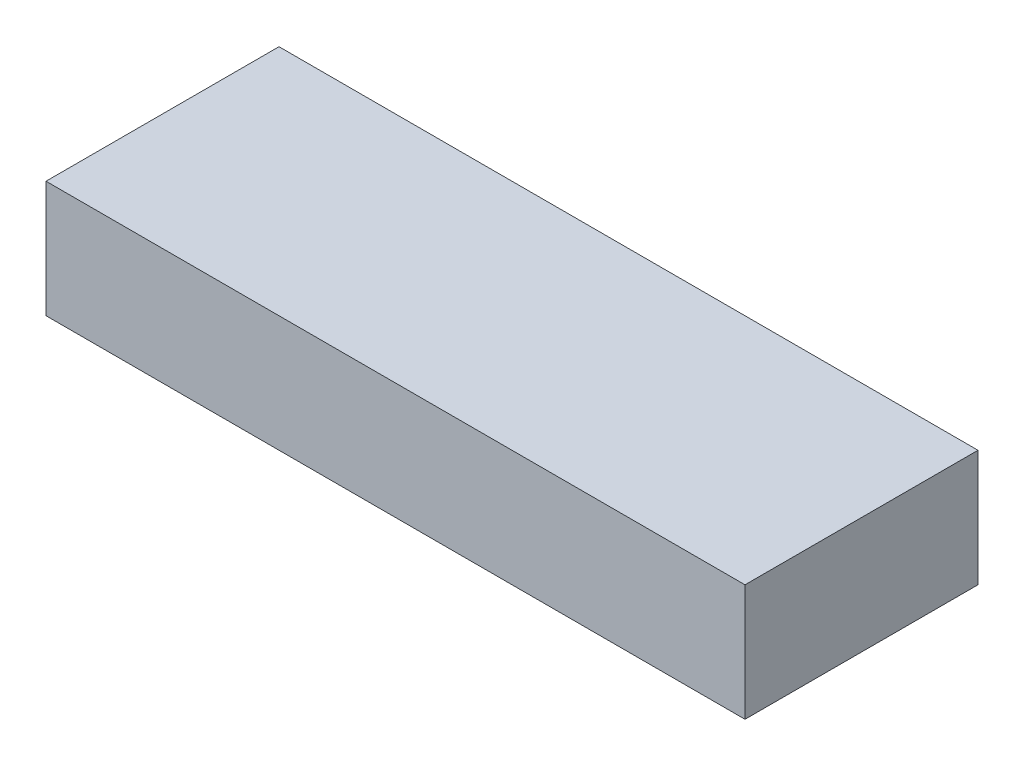
ISO-10303-21;
HEADER;
FILE_DESCRIPTION(('STEP AP214'),'2;1');
FILE_NAME('part.step','',(''),(''),'','','');
FILE_SCHEMA(('AUTOMOTIVE_DESIGN { 1 0 10303 214 1 1 1 1 }'));
ENDSEC;
DATA;
#1=APPLICATION_CONTEXT('core data for automotive mechanical design processes');
#2=APPLICATION_PROTOCOL_DEFINITION('international standard','automotive_design',2000,#1);
#3=PRODUCT_CONTEXT('',#1,'mechanical');
#4=PRODUCT('Part','Part','',(#3));
#5=PRODUCT_RELATED_PRODUCT_CATEGORY('part','',(#4));
#6=PRODUCT_DEFINITION_FORMATION('','',#4);
#7=PRODUCT_DEFINITION_CONTEXT('part definition',#1,'design');
#8=PRODUCT_DEFINITION('design','',#6,#7);
#9=PRODUCT_DEFINITION_SHAPE('','',#8);
#10=(LENGTH_UNIT() NAMED_UNIT(*) SI_UNIT(.MILLI.,.METRE.));
#11=(NAMED_UNIT(*) PLANE_ANGLE_UNIT() SI_UNIT($,.RADIAN.));
#12=(NAMED_UNIT(*) SI_UNIT($,.STERADIAN.) SOLID_ANGLE_UNIT());
#13=UNCERTAINTY_MEASURE_WITH_UNIT(LENGTH_MEASURE(1.E-05),#10,'distance_accuracy_value','');
#14=(GEOMETRIC_REPRESENTATION_CONTEXT(3) GLOBAL_UNCERTAINTY_ASSIGNED_CONTEXT((#13)) GLOBAL_UNIT_ASSIGNED_CONTEXT((#10,
#11,#12)) REPRESENTATION_CONTEXT('',''));
#15=CARTESIAN_POINT('',(0.,0.,0.));
#16=DIRECTION('',(0.,0.,1.));
#17=DIRECTION('',(1.,0.,0.));
#18=AXIS2_PLACEMENT_3D('',#15,#16,#17);
#19=CARTESIAN_POINT('',(0.,25.4,0.));
#20=DIRECTION('',(1.,0.,0.));
#21=DIRECTION('',(0.,0.,-1.));
#22=AXIS2_PLACEMENT_3D('',#19,#20,#21);
#23=PLANE('',#22);
#24=DIRECTION('',(0.,0.,1.));
#25=VECTOR('',#24,1.);
#26=CARTESIAN_POINT('',(0.,0.,0.));
#27=LINE('',#26,#25);
#28=CARTESIAN_POINT('',(0.,0.,-50.8));
#29=VERTEX_POINT('',#28);
#30=CARTESIAN_POINT('',(0.,0.,0.));
#31=VERTEX_POINT('',#30);
#32=EDGE_CURVE('E80',#29,#31,#27,.T.);
#33=ORIENTED_EDGE('',*,*,#32,.T.);
#34=DIRECTION('',(0.,-1.,0.));
#35=VECTOR('',#34,1.);
#36=CARTESIAN_POINT('',(0.,25.4,0.));
#37=LINE('',#36,#35);
#38=CARTESIAN_POINT('',(0.,25.4,0.));
#39=VERTEX_POINT('',#38);
#40=EDGE_CURVE('E11',#39,#31,#37,.T.);
#41=ORIENTED_EDGE('',*,*,#40,.F.);
#42=DIRECTION('',(0.,0.,1.));
#43=VECTOR('',#42,1.);
#44=CARTESIAN_POINT('',(0.,25.4,0.));
#45=LINE('',#44,#43);
#46=CARTESIAN_POINT('',(0.,25.4,-50.8));
#47=VERTEX_POINT('',#46);
#48=EDGE_CURVE('E68',#47,#39,#45,.T.);
#49=ORIENTED_EDGE('',*,*,#48,.F.);
#50=DIRECTION('',(0.,-1.,0.));
#51=VECTOR('',#50,1.);
#52=CARTESIAN_POINT('',(0.,25.4,-50.8));
#53=LINE('',#52,#51);
#54=EDGE_CURVE('E76',#47,#29,#53,.T.);
#55=ORIENTED_EDGE('',*,*,#54,.T.);
#56=EDGE_LOOP('',(#33,#41,#49,#55));
#57=FACE_BOUND('',#56,.T.);
#58=ADVANCED_FACE('F17',(#57),#23,.F.);
#59=CARTESIAN_POINT('',(0.,25.4,0.));
#60=DIRECTION('',(0.,0.,-1.));
#61=DIRECTION('',(-1.,0.,0.));
#62=AXIS2_PLACEMENT_3D('',#59,#60,#61);
#63=PLANE('',#62);
#64=DIRECTION('',(1.,0.,0.));
#65=VECTOR('',#64,1.);
#66=CARTESIAN_POINT('',(0.,0.,0.));
#67=LINE('',#66,#65);
#68=CARTESIAN_POINT('',(152.4,0.,0.));
#69=VERTEX_POINT('',#68);
#70=EDGE_CURVE('E72',#31,#69,#67,.T.);
#71=ORIENTED_EDGE('',*,*,#70,.T.);
#72=DIRECTION('',(0.,-1.,0.));
#73=VECTOR('',#72,1.);
#74=CARTESIAN_POINT('',(152.4,25.4,0.));
#75=LINE('',#74,#73);
#76=CARTESIAN_POINT('',(152.4,25.4,0.));
#77=VERTEX_POINT('',#76);
#78=EDGE_CURVE('E25',#77,#69,#75,.T.);
#79=ORIENTED_EDGE('',*,*,#78,.F.);
#80=DIRECTION('',(1.,0.,0.));
#81=VECTOR('',#80,1.);
#82=CARTESIAN_POINT('',(0.,25.4,0.));
#83=LINE('',#82,#81);
#84=EDGE_CURVE('E63',#39,#77,#83,.T.);
#85=ORIENTED_EDGE('',*,*,#84,.F.);
#86=ORIENTED_EDGE('',*,*,#40,.T.);
#87=EDGE_LOOP('',(#71,#79,#85,#86));
#88=FACE_BOUND('',#87,.T.);
#89=ADVANCED_FACE('F71',(#88),#63,.F.);
#90=CARTESIAN_POINT('',(152.4,25.4,0.));
#91=DIRECTION('',(-1.,0.,0.));
#92=DIRECTION('',(0.,0.,1.));
#93=AXIS2_PLACEMENT_3D('',#90,#91,#92);
#94=PLANE('',#93);
#95=DIRECTION('',(0.,0.,-1.));
#96=VECTOR('',#95,1.);
#97=CARTESIAN_POINT('',(152.4,0.,0.));
#98=LINE('',#97,#96);
#99=CARTESIAN_POINT('',(152.4,0.,-50.8));
#100=VERTEX_POINT('',#99);
#101=EDGE_CURVE('E50',#69,#100,#98,.T.);
#102=ORIENTED_EDGE('',*,*,#101,.T.);
#103=DIRECTION('',(0.,-1.,0.));
#104=VECTOR('',#103,1.);
#105=CARTESIAN_POINT('',(152.4,25.4,-50.8));
#106=LINE('',#105,#104);
#107=CARTESIAN_POINT('',(152.4,25.4,-50.8));
#108=VERTEX_POINT('',#107);
#109=EDGE_CURVE('E73',#108,#100,#106,.T.);
#110=ORIENTED_EDGE('',*,*,#109,.F.);
#111=DIRECTION('',(0.,0.,-1.));
#112=VECTOR('',#111,1.);
#113=CARTESIAN_POINT('',(152.4,25.4,0.));
#114=LINE('',#113,#112);
#115=EDGE_CURVE('E66',#77,#108,#114,.T.);
#116=ORIENTED_EDGE('',*,*,#115,.F.);
#117=ORIENTED_EDGE('',*,*,#78,.T.);
#118=EDGE_LOOP('',(#102,#110,#116,#117));
#119=FACE_BOUND('',#118,.T.);
#120=ADVANCED_FACE('F74',(#119),#94,.F.);
#121=CARTESIAN_POINT('',(0.,25.4,-50.8));
#122=DIRECTION('',(0.,0.,1.));
#123=DIRECTION('',(1.,0.,0.));
#124=AXIS2_PLACEMENT_3D('',#121,#122,#123);
#125=PLANE('',#124);
#126=DIRECTION('',(-1.,0.,0.));
#127=VECTOR('',#126,1.);
#128=CARTESIAN_POINT('',(0.,0.,-50.8));
#129=LINE('',#128,#127);
#130=EDGE_CURVE('E56',#100,#29,#129,.T.);
#131=ORIENTED_EDGE('',*,*,#130,.T.);
#132=ORIENTED_EDGE('',*,*,#54,.F.);
#133=DIRECTION('',(-1.,0.,0.));
#134=VECTOR('',#133,1.);
#135=CARTESIAN_POINT('',(0.,25.4,-50.8));
#136=LINE('',#135,#134);
#137=EDGE_CURVE('E33',#108,#47,#136,.T.);
#138=ORIENTED_EDGE('',*,*,#137,.F.);
#139=ORIENTED_EDGE('',*,*,#109,.T.);
#140=EDGE_LOOP('',(#131,#132,#138,#139));
#141=FACE_BOUND('',#140,.T.);
#142=ADVANCED_FACE('F87',(#141),#125,.F.);
#143=CARTESIAN_POINT('',(0.,25.4,-50.8));
#144=DIRECTION('',(0.,-1.,0.));
#145=DIRECTION('',(0.,0.,-1.));
#146=AXIS2_PLACEMENT_3D('',#143,#144,#145);
#147=PLANE('',#146);
#148=ORIENTED_EDGE('',*,*,#48,.T.);
#149=ORIENTED_EDGE('',*,*,#84,.T.);
#150=ORIENTED_EDGE('',*,*,#115,.T.);
#151=ORIENTED_EDGE('',*,*,#137,.T.);
#152=EDGE_LOOP('',(#148,#149,#150,#151));
#153=FACE_BOUND('',#152,.T.);
#154=ADVANCED_FACE('F64',(#153),#147,.F.);
#155=CARTESIAN_POINT('',(0.,0.,-50.8));
#156=DIRECTION('',(0.,-1.,0.));
#157=DIRECTION('',(0.,0.,-1.));
#158=AXIS2_PLACEMENT_3D('',#155,#156,#157);
#159=PLANE('',#158);
#160=ORIENTED_EDGE('',*,*,#32,.F.);
#161=ORIENTED_EDGE('',*,*,#130,.F.);
#162=ORIENTED_EDGE('',*,*,#101,.F.);
#163=ORIENTED_EDGE('',*,*,#70,.F.);
#164=EDGE_LOOP('',(#160,#161,#162,#163));
#165=FACE_BOUND('',#164,.T.);
#166=ADVANCED_FACE('F90',(#165),#159,.T.);
#167=CLOSED_SHELL('',(#58,#89,#120,#142,#154,#166));
#168=MANIFOLD_SOLID_BREP('B1',#167);
#169=ADVANCED_BREP_SHAPE_REPRESENTATION('',(#18,#168),#14);
#170=SHAPE_DEFINITION_REPRESENTATION(#9,#169);
ENDSEC;
END-ISO-10303-21;
